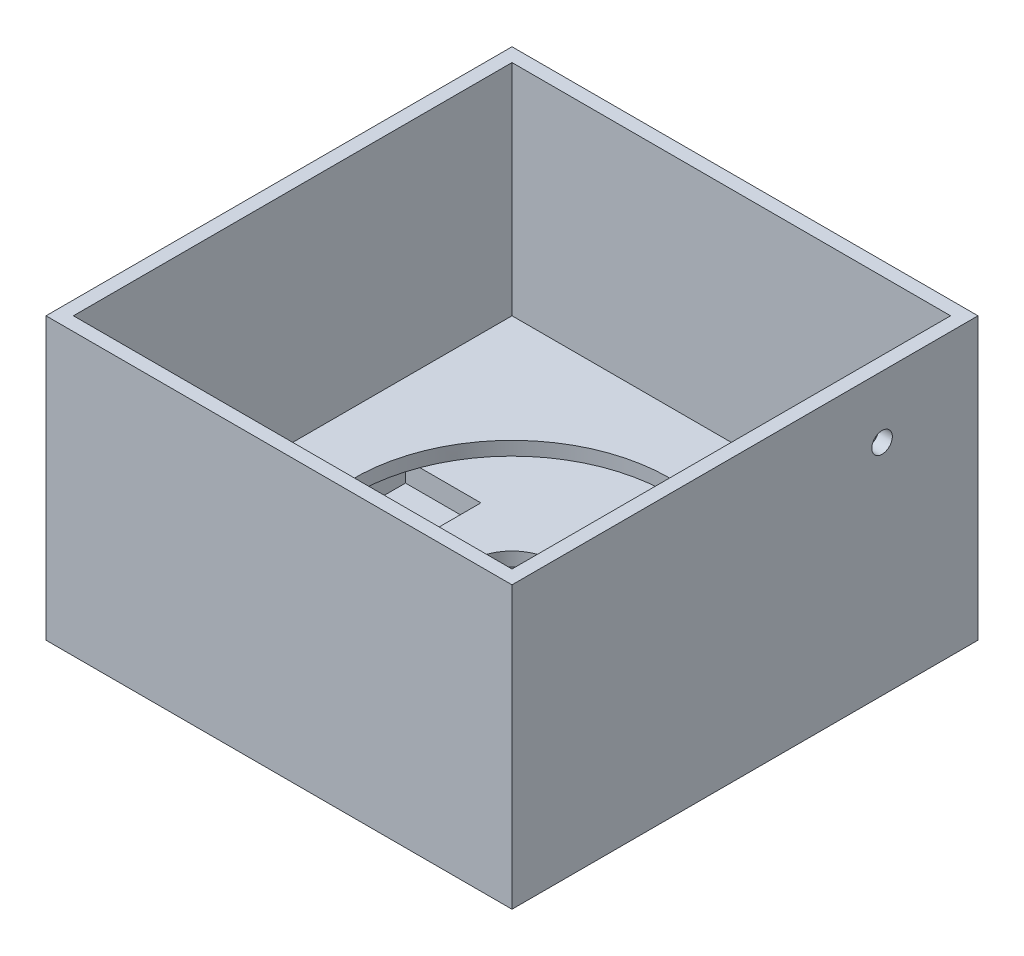
ISO-10303-21;
HEADER;
FILE_DESCRIPTION(('STEP AP214'),'2;1');
FILE_NAME('part.step','',(''),(''),'','','');
FILE_SCHEMA(('AUTOMOTIVE_DESIGN { 1 0 10303 214 1 1 1 1 }'));
ENDSEC;
DATA;
#1=APPLICATION_CONTEXT('core data for automotive mechanical design processes');
#2=APPLICATION_PROTOCOL_DEFINITION('international standard','automotive_design',2000,#1);
#3=PRODUCT_CONTEXT('',#1,'mechanical');
#4=PRODUCT('Part','Part','',(#3));
#5=PRODUCT_RELATED_PRODUCT_CATEGORY('part','',(#4));
#6=PRODUCT_DEFINITION_FORMATION('','',#4);
#7=PRODUCT_DEFINITION_CONTEXT('part definition',#1,'design');
#8=PRODUCT_DEFINITION('design','',#6,#7);
#9=PRODUCT_DEFINITION_SHAPE('','',#8);
#10=(LENGTH_UNIT() NAMED_UNIT(*) SI_UNIT(.MILLI.,.METRE.));
#11=(NAMED_UNIT(*) PLANE_ANGLE_UNIT() SI_UNIT($,.RADIAN.));
#12=(NAMED_UNIT(*) SI_UNIT($,.STERADIAN.) SOLID_ANGLE_UNIT());
#13=UNCERTAINTY_MEASURE_WITH_UNIT(LENGTH_MEASURE(1.E-05),#10,'distance_accuracy_value','');
#14=(GEOMETRIC_REPRESENTATION_CONTEXT(3) GLOBAL_UNCERTAINTY_ASSIGNED_CONTEXT((#13)) GLOBAL_UNIT_ASSIGNED_CONTEXT((#10,
#11,#12)) REPRESENTATION_CONTEXT('',''));
#15=CARTESIAN_POINT('',(0.,0.,0.));
#16=DIRECTION('',(0.,0.,1.));
#17=DIRECTION('',(1.,0.,0.));
#18=AXIS2_PLACEMENT_3D('',#15,#16,#17);
#19=CARTESIAN_POINT('',(0.,0.,0.));
#20=DIRECTION('',(0.,-1.,0.));
#21=DIRECTION('',(0.,0.,-1.));
#22=AXIS2_PLACEMENT_3D('',#19,#20,#21);
#23=PLANE('',#22);
#24=CARTESIAN_POINT('',(0.,0.,0.));
#25=DIRECTION('',(0.,-1.,0.));
#26=DIRECTION('',(0.,0.,-1.));
#27=AXIS2_PLACEMENT_3D('',#24,#25,#26);
#28=CIRCLE('',#27,10.5);
#29=CARTESIAN_POINT('',(0.,0.,-10.5));
#30=VERTEX_POINT('',#29);
#31=EDGE_CURVE('E326',#30,#30,#28,.T.);
#32=ORIENTED_EDGE('',*,*,#31,.F.);
#33=EDGE_LOOP('',(#32));
#34=FACE_BOUND('',#33,.T.);
#35=DIRECTION('',(1.,0.,0.));
#36=VECTOR('',#35,1.);
#37=CARTESIAN_POINT('',(13.,0.,-13.));
#38=LINE('',#37,#36);
#39=CARTESIAN_POINT('',(-13.,0.,-13.));
#40=VERTEX_POINT('',#39);
#41=CARTESIAN_POINT('',(13.,0.,-13.));
#42=VERTEX_POINT('',#41);
#43=EDGE_CURVE('E253',#40,#42,#38,.T.);
#44=ORIENTED_EDGE('',*,*,#43,.T.);
#45=DIRECTION('',(0.,0.,1.));
#46=VECTOR('',#45,1.);
#47=CARTESIAN_POINT('',(13.,0.,-13.));
#48=LINE('',#47,#46);
#49=CARTESIAN_POINT('',(13.,0.,13.));
#50=VERTEX_POINT('',#49);
#51=EDGE_CURVE('E244',#42,#50,#48,.T.);
#52=ORIENTED_EDGE('',*,*,#51,.T.);
#53=DIRECTION('',(-1.,0.,0.));
#54=VECTOR('',#53,1.);
#55=CARTESIAN_POINT('',(13.,0.,13.));
#56=LINE('',#55,#54);
#57=CARTESIAN_POINT('',(-13.,0.,13.));
#58=VERTEX_POINT('',#57);
#59=EDGE_CURVE('E269',#50,#58,#56,.T.);
#60=ORIENTED_EDGE('',*,*,#59,.T.);
#61=DIRECTION('',(0.,0.,-1.));
#62=VECTOR('',#61,1.);
#63=CARTESIAN_POINT('',(-13.,0.,-13.));
#64=LINE('',#63,#62);
#65=EDGE_CURVE('E273',#58,#40,#64,.T.);
#66=ORIENTED_EDGE('',*,*,#65,.T.);
#67=EDGE_LOOP('',(#44,#52,#60,#66));
#68=FACE_BOUND('',#67,.T.);
#69=ADVANCED_FACE('F39',(#34,#68),#23,.T.);
#70=CARTESIAN_POINT('',(0.,0.,0.));
#71=DIRECTION('',(0.,1.,0.));
#72=DIRECTION('',(0.,0.,1.));
#73=AXIS2_PLACEMENT_3D('',#70,#71,#72);
#74=CYLINDRICAL_SURFACE('',#73,6.05);
#75=CARTESIAN_POINT('',(0.,7.,0.));
#76=DIRECTION('',(0.,1.,0.));
#77=DIRECTION('',(0.,0.,1.));
#78=AXIS2_PLACEMENT_3D('',#75,#76,#77);
#79=CIRCLE('',#78,6.05);
#80=CARTESIAN_POINT('',(0.,7.,6.05));
#81=VERTEX_POINT('',#80);
#82=EDGE_CURVE('E343',#81,#81,#79,.T.);
#83=ORIENTED_EDGE('',*,*,#82,.T.);
#84=EDGE_LOOP('',(#83));
#85=FACE_BOUND('',#84,.T.);
#86=CARTESIAN_POINT('',(0.,5.,0.));
#87=DIRECTION('',(0.,-1.,0.));
#88=DIRECTION('',(0.,0.,-1.));
#89=AXIS2_PLACEMENT_3D('',#86,#87,#88);
#90=CIRCLE('',#89,6.05);
#91=CARTESIAN_POINT('',(0.,5.,-6.05));
#92=VERTEX_POINT('',#91);
#93=EDGE_CURVE('E339',#92,#92,#90,.F.);
#94=ORIENTED_EDGE('',*,*,#93,.F.);
#95=EDGE_LOOP('',(#94));
#96=FACE_BOUND('',#95,.T.);
#97=ADVANCED_FACE('F445',(#85,#96),#74,.F.);
#98=CARTESIAN_POINT('',(34.,41.,34.));
#99=DIRECTION('',(-1.,0.,0.));
#100=DIRECTION('',(0.,0.,1.));
#101=AXIS2_PLACEMENT_3D('',#98,#99,#100);
#102=PLANE('',#101);
#103=CARTESIAN_POINT('',(34.,32.,-20.));
#104=DIRECTION('',(-1.,0.,0.));
#105=DIRECTION('',(0.,0.,1.));
#106=AXIS2_PLACEMENT_3D('',#103,#104,#105);
#107=CIRCLE('',#106,1.5);
#108=CARTESIAN_POINT('',(34.,32.,-18.5));
#109=VERTEX_POINT('',#108);
#110=EDGE_CURVE('E240',#109,#109,#107,.T.);
#111=ORIENTED_EDGE('',*,*,#110,.T.);
#112=EDGE_LOOP('',(#111));
#113=FACE_BOUND('',#112,.T.);
#114=DIRECTION('',(0.,0.,-1.));
#115=VECTOR('',#114,1.);
#116=CARTESIAN_POINT('',(34.,0.,34.));
#117=LINE('',#116,#115);
#118=CARTESIAN_POINT('',(34.,0.,34.));
#119=VERTEX_POINT('',#118);
#120=CARTESIAN_POINT('',(34.,0.,-34.));
#121=VERTEX_POINT('',#120);
#122=EDGE_CURVE('E390',#119,#121,#117,.T.);
#123=ORIENTED_EDGE('',*,*,#122,.T.);
#124=DIRECTION('',(0.,-1.,0.));
#125=VECTOR('',#124,1.);
#126=CARTESIAN_POINT('',(34.,41.,-34.));
#127=LINE('',#126,#125);
#128=CARTESIAN_POINT('',(34.,41.,-34.));
#129=VERTEX_POINT('',#128);
#130=EDGE_CURVE('E48',#129,#121,#127,.T.);
#131=ORIENTED_EDGE('',*,*,#130,.F.);
#132=DIRECTION('',(0.,0.,-1.));
#133=VECTOR('',#132,1.);
#134=CARTESIAN_POINT('',(34.,41.,34.));
#135=LINE('',#134,#133);
#136=CARTESIAN_POINT('',(34.,41.,34.));
#137=VERTEX_POINT('',#136);
#138=EDGE_CURVE('E400',#137,#129,#135,.T.);
#139=ORIENTED_EDGE('',*,*,#138,.F.);
#140=DIRECTION('',(0.,-1.,0.));
#141=VECTOR('',#140,1.);
#142=CARTESIAN_POINT('',(34.,41.,34.));
#143=LINE('',#142,#141);
#144=EDGE_CURVE('E414',#137,#119,#143,.T.);
#145=ORIENTED_EDGE('',*,*,#144,.T.);
#146=EDGE_LOOP('',(#123,#131,#139,#145));
#147=FACE_BOUND('',#146,.T.);
#148=ADVANCED_FACE('F41',(#113,#147),#102,.F.);
#149=CARTESIAN_POINT('',(-34.,41.,-34.));
#150=DIRECTION('',(0.,0.,1.));
#151=DIRECTION('',(1.,0.,0.));
#152=AXIS2_PLACEMENT_3D('',#149,#150,#151);
#153=PLANE('',#152);
#154=DIRECTION('',(-1.,0.,0.));
#155=VECTOR('',#154,1.);
#156=CARTESIAN_POINT('',(-34.,0.,-34.));
#157=LINE('',#156,#155);
#158=CARTESIAN_POINT('',(-34.,0.,-34.));
#159=VERTEX_POINT('',#158);
#160=EDGE_CURVE('E418',#121,#159,#157,.T.);
#161=ORIENTED_EDGE('',*,*,#160,.T.);
#162=DIRECTION('',(0.,-1.,0.));
#163=VECTOR('',#162,1.);
#164=CARTESIAN_POINT('',(-34.,41.,-34.));
#165=LINE('',#164,#163);
#166=CARTESIAN_POINT('',(-34.,41.,-34.));
#167=VERTEX_POINT('',#166);
#168=EDGE_CURVE('E433',#167,#159,#165,.T.);
#169=ORIENTED_EDGE('',*,*,#168,.F.);
#170=DIRECTION('',(-1.,0.,0.));
#171=VECTOR('',#170,1.);
#172=CARTESIAN_POINT('',(-34.,41.,-34.));
#173=LINE('',#172,#171);
#174=EDGE_CURVE('E404',#129,#167,#173,.T.);
#175=ORIENTED_EDGE('',*,*,#174,.F.);
#176=ORIENTED_EDGE('',*,*,#130,.T.);
#177=EDGE_LOOP('',(#161,#169,#175,#176));
#178=FACE_BOUND('',#177,.T.);
#179=ADVANCED_FACE('F453',(#178),#153,.F.);
#180=CARTESIAN_POINT('',(-34.,41.,34.));
#181=DIRECTION('',(1.,0.,0.));
#182=DIRECTION('',(0.,0.,-1.));
#183=AXIS2_PLACEMENT_3D('',#180,#181,#182);
#184=PLANE('',#183);
#185=DIRECTION('',(0.,0.,1.));
#186=VECTOR('',#185,1.);
#187=CARTESIAN_POINT('',(-34.,0.,34.));
#188=LINE('',#187,#186);
#189=CARTESIAN_POINT('',(-34.,0.,34.));
#190=VERTEX_POINT('',#189);
#191=EDGE_CURVE('E421',#159,#190,#188,.T.);
#192=ORIENTED_EDGE('',*,*,#191,.T.);
#193=DIRECTION('',(0.,-1.,0.));
#194=VECTOR('',#193,1.);
#195=CARTESIAN_POINT('',(-34.,41.,34.));
#196=LINE('',#195,#194);
#197=CARTESIAN_POINT('',(-34.,41.,34.));
#198=VERTEX_POINT('',#197);
#199=EDGE_CURVE('E429',#198,#190,#196,.T.);
#200=ORIENTED_EDGE('',*,*,#199,.F.);
#201=DIRECTION('',(0.,0.,1.));
#202=VECTOR('',#201,1.);
#203=CARTESIAN_POINT('',(-34.,41.,34.));
#204=LINE('',#203,#202);
#205=EDGE_CURVE('E408',#167,#198,#204,.T.);
#206=ORIENTED_EDGE('',*,*,#205,.F.);
#207=ORIENTED_EDGE('',*,*,#168,.T.);
#208=EDGE_LOOP('',(#192,#200,#206,#207));
#209=FACE_BOUND('',#208,.T.);
#210=ADVANCED_FACE('F500',(#209),#184,.F.);
#211=CARTESIAN_POINT('',(-34.,41.,34.));
#212=DIRECTION('',(0.,0.,-1.));
#213=DIRECTION('',(-1.,0.,0.));
#214=AXIS2_PLACEMENT_3D('',#211,#212,#213);
#215=PLANE('',#214);
#216=DIRECTION('',(1.,0.,0.));
#217=VECTOR('',#216,1.);
#218=CARTESIAN_POINT('',(-34.,0.,34.));
#219=LINE('',#218,#217);
#220=EDGE_CURVE('E405',#190,#119,#219,.T.);
#221=ORIENTED_EDGE('',*,*,#220,.T.);
#222=ORIENTED_EDGE('',*,*,#144,.F.);
#223=DIRECTION('',(1.,0.,0.));
#224=VECTOR('',#223,1.);
#225=CARTESIAN_POINT('',(-34.,41.,34.));
#226=LINE('',#225,#224);
#227=EDGE_CURVE('E411',#198,#137,#226,.T.);
#228=ORIENTED_EDGE('',*,*,#227,.F.);
#229=ORIENTED_EDGE('',*,*,#199,.T.);
#230=EDGE_LOOP('',(#221,#222,#228,#229));
#231=FACE_BOUND('',#230,.T.);
#232=ADVANCED_FACE('F493',(#231),#215,.F.);
#233=CARTESIAN_POINT('',(0.,41.,0.));
#234=DIRECTION('',(0.,-1.,0.));
#235=DIRECTION('',(0.,0.,-1.));
#236=AXIS2_PLACEMENT_3D('',#233,#234,#235);
#237=PLANE('',#236);
#238=DIRECTION('',(-1.,0.,0.));
#239=VECTOR('',#238,1.);
#240=CARTESIAN_POINT('',(0.,41.,-32.));
#241=LINE('',#240,#239);
#242=CARTESIAN_POINT('',(32.,41.,-32.));
#243=VERTEX_POINT('',#242);
#244=CARTESIAN_POINT('',(-32.,41.,-32.));
#245=VERTEX_POINT('',#244);
#246=EDGE_CURVE('E376',#243,#245,#241,.T.);
#247=ORIENTED_EDGE('',*,*,#246,.F.);
#248=DIRECTION('',(0.,0.,-1.));
#249=VECTOR('',#248,1.);
#250=CARTESIAN_POINT('',(32.,41.,0.));
#251=LINE('',#250,#249);
#252=CARTESIAN_POINT('',(32.,41.,32.));
#253=VERTEX_POINT('',#252);
#254=EDGE_CURVE('E351',#253,#243,#251,.T.);
#255=ORIENTED_EDGE('',*,*,#254,.F.);
#256=DIRECTION('',(1.,0.,0.));
#257=VECTOR('',#256,1.);
#258=CARTESIAN_POINT('',(0.,41.,32.));
#259=LINE('',#258,#257);
#260=CARTESIAN_POINT('',(-32.,41.,32.));
#261=VERTEX_POINT('',#260);
#262=EDGE_CURVE('E361',#261,#253,#259,.T.);
#263=ORIENTED_EDGE('',*,*,#262,.F.);
#264=DIRECTION('',(0.,0.,1.));
#265=VECTOR('',#264,1.);
#266=CARTESIAN_POINT('',(-32.,41.,0.));
#267=LINE('',#266,#265);
#268=EDGE_CURVE('E380',#245,#261,#267,.T.);
#269=ORIENTED_EDGE('',*,*,#268,.F.);
#270=EDGE_LOOP('',(#247,#255,#263,#269));
#271=FACE_BOUND('',#270,.T.);
#272=ORIENTED_EDGE('',*,*,#138,.T.);
#273=ORIENTED_EDGE('',*,*,#174,.T.);
#274=ORIENTED_EDGE('',*,*,#205,.T.);
#275=ORIENTED_EDGE('',*,*,#227,.T.);
#276=EDGE_LOOP('',(#272,#273,#274,#275));
#277=FACE_BOUND('',#276,.T.);
#278=ADVANCED_FACE('F491',(#271,#277),#237,.F.);
#279=DIRECTION('',(0.,0.,1.));
#280=VECTOR('',#279,1.);
#281=CARTESIAN_POINT('',(15.,0.,-15.));
#282=LINE('',#281,#280);
#283=CARTESIAN_POINT('',(15.,0.,-15.));
#284=VERTEX_POINT('',#283);
#285=CARTESIAN_POINT('',(15.,0.,15.));
#286=VERTEX_POINT('',#285);
#287=EDGE_CURVE('E62',#284,#286,#282,.T.);
#288=ORIENTED_EDGE('',*,*,#287,.F.);
#289=DIRECTION('',(1.,0.,0.));
#290=VECTOR('',#289,1.);
#291=CARTESIAN_POINT('',(15.,0.,-15.));
#292=LINE('',#291,#290);
#293=CARTESIAN_POINT('',(-15.,0.,-15.));
#294=VERTEX_POINT('',#293);
#295=EDGE_CURVE('E297',#294,#284,#292,.T.);
#296=ORIENTED_EDGE('',*,*,#295,.F.);
#297=DIRECTION('',(0.,0.,-1.));
#298=VECTOR('',#297,1.);
#299=CARTESIAN_POINT('',(-15.,0.,-15.));
#300=LINE('',#299,#298);
#301=CARTESIAN_POINT('',(-15.,0.,15.));
#302=VERTEX_POINT('',#301);
#303=EDGE_CURVE('E316',#302,#294,#300,.T.);
#304=ORIENTED_EDGE('',*,*,#303,.F.);
#305=DIRECTION('',(-1.,0.,0.));
#306=VECTOR('',#305,1.);
#307=CARTESIAN_POINT('',(15.,0.,15.));
#308=LINE('',#307,#306);
#309=EDGE_CURVE('E312',#286,#302,#308,.T.);
#310=ORIENTED_EDGE('',*,*,#309,.F.);
#311=EDGE_LOOP('',(#288,#296,#304,#310));
#312=FACE_BOUND('',#311,.T.);
#313=ORIENTED_EDGE('',*,*,#122,.F.);
#314=ORIENTED_EDGE('',*,*,#220,.F.);
#315=ORIENTED_EDGE('',*,*,#191,.F.);
#316=ORIENTED_EDGE('',*,*,#160,.F.);
#317=EDGE_LOOP('',(#313,#314,#315,#316));
#318=FACE_BOUND('',#317,.T.);
#319=ADVANCED_FACE('F457',(#312,#318),#23,.T.);
#320=CARTESIAN_POINT('',(32.,9.,0.));
#321=DIRECTION('',(1.,0.,0.));
#322=DIRECTION('',(0.,0.,-1.));
#323=AXIS2_PLACEMENT_3D('',#320,#321,#322);
#324=PLANE('',#323);
#325=CARTESIAN_POINT('',(32.,32.,-20.));
#326=DIRECTION('',(-1.,0.,0.));
#327=DIRECTION('',(0.,0.,1.));
#328=AXIS2_PLACEMENT_3D('',#325,#326,#327);
#329=CIRCLE('',#328,1.5);
#330=CARTESIAN_POINT('',(32.,32.,-18.5));
#331=VERTEX_POINT('',#330);
#332=EDGE_CURVE('E234',#331,#331,#329,.T.);
#333=ORIENTED_EDGE('',*,*,#332,.F.);
#334=EDGE_LOOP('',(#333));
#335=FACE_BOUND('',#334,.T.);
#336=ORIENTED_EDGE('',*,*,#254,.T.);
#337=DIRECTION('',(0.,1.,0.));
#338=VECTOR('',#337,1.);
#339=CARTESIAN_POINT('',(32.,9.,-32.));
#340=LINE('',#339,#338);
#341=CARTESIAN_POINT('',(32.,9.,-32.));
#342=VERTEX_POINT('',#341);
#343=EDGE_CURVE('E373',#342,#243,#340,.T.);
#344=ORIENTED_EDGE('',*,*,#343,.F.);
#345=DIRECTION('',(0.,0.,-1.));
#346=VECTOR('',#345,1.);
#347=CARTESIAN_POINT('',(32.,9.,0.));
#348=LINE('',#347,#346);
#349=CARTESIAN_POINT('',(32.,9.,32.));
#350=VERTEX_POINT('',#349);
#351=EDGE_CURVE('E356',#350,#342,#348,.T.);
#352=ORIENTED_EDGE('',*,*,#351,.F.);
#353=DIRECTION('',(0.,1.,0.));
#354=VECTOR('',#353,1.);
#355=CARTESIAN_POINT('',(32.,9.,32.));
#356=LINE('',#355,#354);
#357=EDGE_CURVE('E387',#350,#253,#356,.T.);
#358=ORIENTED_EDGE('',*,*,#357,.T.);
#359=EDGE_LOOP('',(#336,#344,#352,#358));
#360=FACE_BOUND('',#359,.T.);
#361=ADVANCED_FACE('F480',(#335,#360),#324,.F.);
#362=CARTESIAN_POINT('',(0.,9.,32.));
#363=DIRECTION('',(0.,0.,1.));
#364=DIRECTION('',(1.,0.,0.));
#365=AXIS2_PLACEMENT_3D('',#362,#363,#364);
#366=PLANE('',#365);
#367=ORIENTED_EDGE('',*,*,#262,.T.);
#368=ORIENTED_EDGE('',*,*,#357,.F.);
#369=DIRECTION('',(1.,0.,0.));
#370=VECTOR('',#369,1.);
#371=CARTESIAN_POINT('',(0.,9.,32.));
#372=LINE('',#371,#370);
#373=CARTESIAN_POINT('',(-32.,9.,32.));
#374=VERTEX_POINT('',#373);
#375=EDGE_CURVE('E369',#374,#350,#372,.T.);
#376=ORIENTED_EDGE('',*,*,#375,.F.);
#377=DIRECTION('',(0.,1.,0.));
#378=VECTOR('',#377,1.);
#379=CARTESIAN_POINT('',(-32.,9.,32.));
#380=LINE('',#379,#378);
#381=EDGE_CURVE('E391',#374,#261,#380,.T.);
#382=ORIENTED_EDGE('',*,*,#381,.T.);
#383=EDGE_LOOP('',(#367,#368,#376,#382));
#384=FACE_BOUND('',#383,.T.);
#385=ADVANCED_FACE('F476',(#384),#366,.F.);
#386=CARTESIAN_POINT('',(-32.,9.,0.));
#387=DIRECTION('',(-1.,0.,0.));
#388=DIRECTION('',(0.,0.,1.));
#389=AXIS2_PLACEMENT_3D('',#386,#387,#388);
#390=PLANE('',#389);
#391=ORIENTED_EDGE('',*,*,#268,.T.);
#392=ORIENTED_EDGE('',*,*,#381,.F.);
#393=DIRECTION('',(0.,0.,1.));
#394=VECTOR('',#393,1.);
#395=CARTESIAN_POINT('',(-32.,9.,0.));
#396=LINE('',#395,#394);
#397=CARTESIAN_POINT('',(-32.,9.,-32.));
#398=VERTEX_POINT('',#397);
#399=EDGE_CURVE('E365',#398,#374,#396,.T.);
#400=ORIENTED_EDGE('',*,*,#399,.F.);
#401=DIRECTION('',(0.,1.,0.));
#402=VECTOR('',#401,1.);
#403=CARTESIAN_POINT('',(-32.,9.,-32.));
#404=LINE('',#403,#402);
#405=EDGE_CURVE('E394',#398,#245,#404,.T.);
#406=ORIENTED_EDGE('',*,*,#405,.T.);
#407=EDGE_LOOP('',(#391,#392,#400,#406));
#408=FACE_BOUND('',#407,.T.);
#409=ADVANCED_FACE('F479',(#408),#390,.F.);
#410=CARTESIAN_POINT('',(0.,9.,-32.));
#411=DIRECTION('',(0.,0.,-1.));
#412=DIRECTION('',(-1.,0.,0.));
#413=AXIS2_PLACEMENT_3D('',#410,#411,#412);
#414=PLANE('',#413);
#415=ORIENTED_EDGE('',*,*,#246,.T.);
#416=ORIENTED_EDGE('',*,*,#405,.F.);
#417=DIRECTION('',(-1.,0.,0.));
#418=VECTOR('',#417,1.);
#419=CARTESIAN_POINT('',(0.,9.,-32.));
#420=LINE('',#419,#418);
#421=EDGE_CURVE('E360',#342,#398,#420,.T.);
#422=ORIENTED_EDGE('',*,*,#421,.F.);
#423=ORIENTED_EDGE('',*,*,#343,.T.);
#424=EDGE_LOOP('',(#415,#416,#422,#423));
#425=FACE_BOUND('',#424,.T.);
#426=ADVANCED_FACE('F474',(#425),#414,.F.);
#427=CARTESIAN_POINT('',(0.,9.,0.));
#428=DIRECTION('',(0.,1.,0.));
#429=DIRECTION('',(0.,0.,1.));
#430=AXIS2_PLACEMENT_3D('',#427,#428,#429);
#431=PLANE('',#430);
#432=CARTESIAN_POINT('',(0.,9.,0.));
#433=DIRECTION('',(0.,1.,0.));
#434=DIRECTION('',(0.,0.,1.));
#435=AXIS2_PLACEMENT_3D('',#432,#433,#434);
#436=CIRCLE('',#435,23.);
#437=CARTESIAN_POINT('',(0.,9.,23.));
#438=VERTEX_POINT('',#437);
#439=EDGE_CURVE('E347',#438,#438,#436,.T.);
#440=ORIENTED_EDGE('',*,*,#439,.F.);
#441=EDGE_LOOP('',(#440));
#442=FACE_BOUND('',#441,.T.);
#443=ORIENTED_EDGE('',*,*,#351,.T.);
#444=ORIENTED_EDGE('',*,*,#421,.T.);
#445=ORIENTED_EDGE('',*,*,#399,.T.);
#446=ORIENTED_EDGE('',*,*,#375,.T.);
#447=EDGE_LOOP('',(#443,#444,#445,#446));
#448=FACE_BOUND('',#447,.T.);
#449=ADVANCED_FACE('F470',(#442,#448),#431,.T.);
#450=CARTESIAN_POINT('',(0.,7.,0.));
#451=DIRECTION('',(0.,1.,0.));
#452=DIRECTION('',(0.,0.,1.));
#453=AXIS2_PLACEMENT_3D('',#450,#451,#452);
#454=CYLINDRICAL_SURFACE('',#453,23.);
#455=CARTESIAN_POINT('',(0.,7.,0.));
#456=DIRECTION('',(0.,1.,0.));
#457=DIRECTION('',(0.,0.,1.));
#458=AXIS2_PLACEMENT_3D('',#455,#456,#457);
#459=CIRCLE('',#458,23.);
#460=CARTESIAN_POINT('',(-21.5316964114081,7.,-8.08616408731332));
#461=VERTEX_POINT('',#460);
#462=CARTESIAN_POINT('',(-21.5956292139653,7.,7.91383591268668));
#463=VERTEX_POINT('',#462);
#464=EDGE_CURVE('E348',#461,#463,#459,.T.);
#465=ORIENTED_EDGE('',*,*,#464,.F.);
#466=EDGE_CURVE('E352',#463,#461,#459,.T.);
#467=ORIENTED_EDGE('',*,*,#466,.F.);
#468=EDGE_LOOP('',(#465,#467));
#469=FACE_BOUND('',#468,.T.);
#470=ORIENTED_EDGE('',*,*,#439,.T.);
#471=EDGE_LOOP('',(#470));
#472=FACE_BOUND('',#471,.T.);
#473=ADVANCED_FACE('F465',(#469,#472),#454,.F.);
#474=CARTESIAN_POINT('',(0.,7.,0.));
#475=DIRECTION('',(0.,1.,0.));
#476=DIRECTION('',(0.,0.,1.));
#477=AXIS2_PLACEMENT_3D('',#474,#475,#476);
#478=PLANE('',#477);
#479=DIRECTION('',(-1.,0.,0.));
#480=VECTOR('',#479,1.);
#481=CARTESIAN_POINT('',(-12.6259035290733,7.,-8.08616408731332));
#482=LINE('',#481,#480);
#483=CARTESIAN_POINT('',(-12.6259035290733,7.,-8.08616408731332));
#484=VERTEX_POINT('',#483);
#485=EDGE_CURVE('E208',#484,#461,#482,.T.);
#486=ORIENTED_EDGE('',*,*,#485,.F.);
#487=DIRECTION('',(0.,0.,-1.));
#488=VECTOR('',#487,1.);
#489=CARTESIAN_POINT('',(-12.6259035290733,7.,7.91383591268668));
#490=LINE('',#489,#488);
#491=CARTESIAN_POINT('',(-12.6259035290733,7.,7.91383591268668));
#492=VERTEX_POINT('',#491);
#493=EDGE_CURVE('E227',#492,#484,#490,.T.);
#494=ORIENTED_EDGE('',*,*,#493,.F.);
#495=DIRECTION('',(1.,0.,0.));
#496=VECTOR('',#495,1.);
#497=CARTESIAN_POINT('',(0.,7.,7.91383591268668));
#498=LINE('',#497,#496);
#499=EDGE_CURVE('E11',#463,#492,#498,.T.);
#500=ORIENTED_EDGE('',*,*,#499,.F.);
#501=ORIENTED_EDGE('',*,*,#466,.T.);
#502=EDGE_LOOP('',(#486,#494,#500,#501));
#503=FACE_BOUND('',#502,.T.);
#504=ORIENTED_EDGE('',*,*,#82,.F.);
#505=EDGE_LOOP('',(#504));
#506=FACE_BOUND('',#505,.T.);
#507=ADVANCED_FACE('F462',(#503,#506),#478,.T.);
#508=CARTESIAN_POINT('',(0.,5.,0.));
#509=DIRECTION('',(0.,-1.,0.));
#510=DIRECTION('',(0.,0.,-1.));
#511=AXIS2_PLACEMENT_3D('',#508,#509,#510);
#512=PLANE('',#511);
#513=CARTESIAN_POINT('',(0.,5.,0.));
#514=DIRECTION('',(0.,-1.,0.));
#515=DIRECTION('',(0.,0.,-1.));
#516=AXIS2_PLACEMENT_3D('',#513,#514,#515);
#517=CIRCLE('',#516,10.5);
#518=CARTESIAN_POINT('',(0.,5.,-10.5));
#519=VERTEX_POINT('',#518);
#520=EDGE_CURVE('E335',#519,#519,#517,.T.);
#521=ORIENTED_EDGE('',*,*,#520,.T.);
#522=EDGE_LOOP('',(#521));
#523=FACE_BOUND('',#522,.T.);
#524=ORIENTED_EDGE('',*,*,#93,.T.);
#525=EDGE_LOOP('',(#524));
#526=FACE_BOUND('',#525,.T.);
#527=ADVANCED_FACE('F443',(#523,#526),#512,.T.);
#528=CARTESIAN_POINT('',(0.,5.,0.));
#529=DIRECTION('',(0.,-1.,0.));
#530=DIRECTION('',(0.,0.,-1.));
#531=AXIS2_PLACEMENT_3D('',#528,#529,#530);
#532=CYLINDRICAL_SURFACE('',#531,10.5);
#533=ORIENTED_EDGE('',*,*,#520,.F.);
#534=EDGE_LOOP('',(#533));
#535=FACE_BOUND('',#534,.T.);
#536=ORIENTED_EDGE('',*,*,#31,.T.);
#537=EDGE_LOOP('',(#536));
#538=FACE_BOUND('',#537,.T.);
#539=ADVANCED_FACE('F460',(#535,#538),#532,.F.);
#540=CARTESIAN_POINT('',(15.,2.,-15.));
#541=DIRECTION('',(1.,0.,0.));
#542=DIRECTION('',(0.,0.,-1.));
#543=AXIS2_PLACEMENT_3D('',#540,#541,#542);
#544=PLANE('',#543);
#545=ORIENTED_EDGE('',*,*,#287,.T.);
#546=DIRECTION('',(0.,-1.,0.));
#547=VECTOR('',#546,1.);
#548=CARTESIAN_POINT('',(15.,2.,15.));
#549=LINE('',#548,#547);
#550=CARTESIAN_POINT('',(15.,2.,15.));
#551=VERTEX_POINT('',#550);
#552=EDGE_CURVE('E309',#551,#286,#549,.T.);
#553=ORIENTED_EDGE('',*,*,#552,.F.);
#554=DIRECTION('',(0.,0.,1.));
#555=VECTOR('',#554,1.);
#556=CARTESIAN_POINT('',(15.,2.,-15.));
#557=LINE('',#556,#555);
#558=CARTESIAN_POINT('',(15.,2.,-15.));
#559=VERTEX_POINT('',#558);
#560=EDGE_CURVE('E292',#559,#551,#557,.T.);
#561=ORIENTED_EDGE('',*,*,#560,.F.);
#562=DIRECTION('',(0.,-1.,0.));
#563=VECTOR('',#562,1.);
#564=CARTESIAN_POINT('',(15.,2.,-15.));
#565=LINE('',#564,#563);
#566=EDGE_CURVE('E323',#559,#284,#565,.T.);
#567=ORIENTED_EDGE('',*,*,#566,.T.);
#568=EDGE_LOOP('',(#545,#553,#561,#567));
#569=FACE_BOUND('',#568,.T.);
#570=ADVANCED_FACE('F583',(#569),#544,.F.);
#571=CARTESIAN_POINT('',(15.,2.,-15.));
#572=DIRECTION('',(0.,0.,-1.));
#573=DIRECTION('',(-1.,0.,0.));
#574=AXIS2_PLACEMENT_3D('',#571,#572,#573);
#575=PLANE('',#574);
#576=ORIENTED_EDGE('',*,*,#295,.T.);
#577=ORIENTED_EDGE('',*,*,#566,.F.);
#578=DIRECTION('',(1.,0.,0.));
#579=VECTOR('',#578,1.);
#580=CARTESIAN_POINT('',(15.,2.,-15.));
#581=LINE('',#580,#579);
#582=CARTESIAN_POINT('',(-15.,2.,-15.));
#583=VERTEX_POINT('',#582);
#584=EDGE_CURVE('E305',#583,#559,#581,.T.);
#585=ORIENTED_EDGE('',*,*,#584,.F.);
#586=DIRECTION('',(0.,-1.,0.));
#587=VECTOR('',#586,1.);
#588=CARTESIAN_POINT('',(-15.,2.,-15.));
#589=LINE('',#588,#587);
#590=EDGE_CURVE('E327',#583,#294,#589,.T.);
#591=ORIENTED_EDGE('',*,*,#590,.T.);
#592=EDGE_LOOP('',(#576,#577,#585,#591));
#593=FACE_BOUND('',#592,.T.);
#594=ADVANCED_FACE('F589',(#593),#575,.F.);
#595=CARTESIAN_POINT('',(-15.,2.,-15.));
#596=DIRECTION('',(-1.,0.,0.));
#597=DIRECTION('',(0.,0.,1.));
#598=AXIS2_PLACEMENT_3D('',#595,#596,#597);
#599=PLANE('',#598);
#600=ORIENTED_EDGE('',*,*,#303,.T.);
#601=ORIENTED_EDGE('',*,*,#590,.F.);
#602=DIRECTION('',(0.,0.,-1.));
#603=VECTOR('',#602,1.);
#604=CARTESIAN_POINT('',(-15.,2.,-15.));
#605=LINE('',#604,#603);
#606=CARTESIAN_POINT('',(-15.,2.,15.));
#607=VERTEX_POINT('',#606);
#608=EDGE_CURVE('E301',#607,#583,#605,.T.);
#609=ORIENTED_EDGE('',*,*,#608,.F.);
#610=DIRECTION('',(0.,-1.,0.));
#611=VECTOR('',#610,1.);
#612=CARTESIAN_POINT('',(-15.,2.,15.));
#613=LINE('',#612,#611);
#614=EDGE_CURVE('E330',#607,#302,#613,.T.);
#615=ORIENTED_EDGE('',*,*,#614,.T.);
#616=EDGE_LOOP('',(#600,#601,#609,#615));
#617=FACE_BOUND('',#616,.T.);
#618=ADVANCED_FACE('F596',(#617),#599,.F.);
#619=CARTESIAN_POINT('',(15.,2.,15.));
#620=DIRECTION('',(0.,0.,1.));
#621=DIRECTION('',(1.,0.,0.));
#622=AXIS2_PLACEMENT_3D('',#619,#620,#621);
#623=PLANE('',#622);
#624=ORIENTED_EDGE('',*,*,#309,.T.);
#625=ORIENTED_EDGE('',*,*,#614,.F.);
#626=DIRECTION('',(-1.,0.,0.));
#627=VECTOR('',#626,1.);
#628=CARTESIAN_POINT('',(15.,2.,15.));
#629=LINE('',#628,#627);
#630=EDGE_CURVE('E296',#551,#607,#629,.T.);
#631=ORIENTED_EDGE('',*,*,#630,.F.);
#632=ORIENTED_EDGE('',*,*,#552,.T.);
#633=EDGE_LOOP('',(#624,#625,#631,#632));
#634=FACE_BOUND('',#633,.T.);
#635=ADVANCED_FACE('F604',(#634),#623,.F.);
#636=CARTESIAN_POINT('',(0.,2.,0.));
#637=DIRECTION('',(0.,-1.,0.));
#638=DIRECTION('',(0.,0.,-1.));
#639=AXIS2_PLACEMENT_3D('',#636,#637,#638);
#640=PLANE('',#639);
#641=DIRECTION('',(1.,0.,0.));
#642=VECTOR('',#641,1.);
#643=CARTESIAN_POINT('',(13.,2.,-13.));
#644=LINE('',#643,#642);
#645=CARTESIAN_POINT('',(-13.,2.,-13.));
#646=VERTEX_POINT('',#645);
#647=CARTESIAN_POINT('',(13.,2.,-13.));
#648=VERTEX_POINT('',#647);
#649=EDGE_CURVE('E261',#646,#648,#644,.T.);
#650=ORIENTED_EDGE('',*,*,#649,.F.);
#651=DIRECTION('',(0.,0.,-1.));
#652=VECTOR('',#651,1.);
#653=CARTESIAN_POINT('',(-13.,2.,-13.));
#654=LINE('',#653,#652);
#655=CARTESIAN_POINT('',(-13.,2.,13.));
#656=VERTEX_POINT('',#655);
#657=EDGE_CURVE('E257',#656,#646,#654,.T.);
#658=ORIENTED_EDGE('',*,*,#657,.F.);
#659=DIRECTION('',(-1.,0.,0.));
#660=VECTOR('',#659,1.);
#661=CARTESIAN_POINT('',(13.,2.,13.));
#662=LINE('',#661,#660);
#663=CARTESIAN_POINT('',(13.,2.,13.));
#664=VERTEX_POINT('',#663);
#665=EDGE_CURVE('E252',#664,#656,#662,.T.);
#666=ORIENTED_EDGE('',*,*,#665,.F.);
#667=DIRECTION('',(0.,0.,1.));
#668=VECTOR('',#667,1.);
#669=CARTESIAN_POINT('',(13.,2.,-13.));
#670=LINE('',#669,#668);
#671=EDGE_CURVE('E248',#648,#664,#670,.T.);
#672=ORIENTED_EDGE('',*,*,#671,.F.);
#673=EDGE_LOOP('',(#650,#658,#666,#672));
#674=FACE_BOUND('',#673,.T.);
#675=ORIENTED_EDGE('',*,*,#560,.T.);
#676=ORIENTED_EDGE('',*,*,#630,.T.);
#677=ORIENTED_EDGE('',*,*,#608,.T.);
#678=ORIENTED_EDGE('',*,*,#584,.T.);
#679=EDGE_LOOP('',(#675,#676,#677,#678));
#680=FACE_BOUND('',#679,.T.);
#681=ADVANCED_FACE('F612',(#674,#680),#640,.T.);
#682=CARTESIAN_POINT('',(13.,2.,-13.));
#683=DIRECTION('',(1.,0.,0.));
#684=DIRECTION('',(0.,0.,-1.));
#685=AXIS2_PLACEMENT_3D('',#682,#683,#684);
#686=PLANE('',#685);
#687=ORIENTED_EDGE('',*,*,#51,.F.);
#688=DIRECTION('',(0.,-1.,0.));
#689=VECTOR('',#688,1.);
#690=CARTESIAN_POINT('',(13.,2.,-13.));
#691=LINE('',#690,#689);
#692=EDGE_CURVE('E280',#648,#42,#691,.T.);
#693=ORIENTED_EDGE('',*,*,#692,.F.);
#694=ORIENTED_EDGE('',*,*,#671,.T.);
#695=DIRECTION('',(0.,-1.,0.));
#696=VECTOR('',#695,1.);
#697=CARTESIAN_POINT('',(13.,2.,13.));
#698=LINE('',#697,#696);
#699=EDGE_CURVE('E265',#664,#50,#698,.T.);
#700=ORIENTED_EDGE('',*,*,#699,.T.);
#701=EDGE_LOOP('',(#687,#693,#694,#700));
#702=FACE_BOUND('',#701,.T.);
#703=ADVANCED_FACE('F620',(#702),#686,.T.);
#704=CARTESIAN_POINT('',(13.,2.,-13.));
#705=DIRECTION('',(0.,0.,-1.));
#706=DIRECTION('',(-1.,0.,0.));
#707=AXIS2_PLACEMENT_3D('',#704,#705,#706);
#708=PLANE('',#707);
#709=ORIENTED_EDGE('',*,*,#43,.F.);
#710=DIRECTION('',(0.,-1.,0.));
#711=VECTOR('',#710,1.);
#712=CARTESIAN_POINT('',(-13.,2.,-13.));
#713=LINE('',#712,#711);
#714=EDGE_CURVE('E283',#646,#40,#713,.T.);
#715=ORIENTED_EDGE('',*,*,#714,.F.);
#716=ORIENTED_EDGE('',*,*,#649,.T.);
#717=ORIENTED_EDGE('',*,*,#692,.T.);
#718=EDGE_LOOP('',(#709,#715,#716,#717));
#719=FACE_BOUND('',#718,.T.);
#720=ADVANCED_FACE('F628',(#719),#708,.T.);
#721=CARTESIAN_POINT('',(-13.,2.,-13.));
#722=DIRECTION('',(-1.,0.,0.));
#723=DIRECTION('',(0.,0.,1.));
#724=AXIS2_PLACEMENT_3D('',#721,#722,#723);
#725=PLANE('',#724);
#726=ORIENTED_EDGE('',*,*,#65,.F.);
#727=DIRECTION('',(0.,-1.,0.));
#728=VECTOR('',#727,1.);
#729=CARTESIAN_POINT('',(-13.,2.,13.));
#730=LINE('',#729,#728);
#731=EDGE_CURVE('E286',#656,#58,#730,.T.);
#732=ORIENTED_EDGE('',*,*,#731,.F.);
#733=ORIENTED_EDGE('',*,*,#657,.T.);
#734=ORIENTED_EDGE('',*,*,#714,.T.);
#735=EDGE_LOOP('',(#726,#732,#733,#734));
#736=FACE_BOUND('',#735,.T.);
#737=ADVANCED_FACE('F636',(#736),#725,.T.);
#738=CARTESIAN_POINT('',(13.,2.,13.));
#739=DIRECTION('',(0.,0.,1.));
#740=DIRECTION('',(1.,0.,0.));
#741=AXIS2_PLACEMENT_3D('',#738,#739,#740);
#742=PLANE('',#741);
#743=ORIENTED_EDGE('',*,*,#59,.F.);
#744=ORIENTED_EDGE('',*,*,#699,.F.);
#745=ORIENTED_EDGE('',*,*,#665,.T.);
#746=ORIENTED_EDGE('',*,*,#731,.T.);
#747=EDGE_LOOP('',(#743,#744,#745,#746));
#748=FACE_BOUND('',#747,.T.);
#749=ADVANCED_FACE('F644',(#748),#742,.T.);
#750=CARTESIAN_POINT('',(34.,32.,-20.));
#751=DIRECTION('',(-1.,0.,0.));
#752=DIRECTION('',(0.,0.,1.));
#753=AXIS2_PLACEMENT_3D('',#750,#751,#752);
#754=CYLINDRICAL_SURFACE('',#753,1.5);
#755=ORIENTED_EDGE('',*,*,#110,.F.);
#756=EDGE_LOOP('',(#755));
#757=FACE_BOUND('',#756,.T.);
#758=ORIENTED_EDGE('',*,*,#332,.T.);
#759=EDGE_LOOP('',(#758));
#760=FACE_BOUND('',#759,.T.);
#761=ADVANCED_FACE('F652',(#757,#760),#754,.F.);
#762=CARTESIAN_POINT('',(0.,7.,0.));
#763=DIRECTION('',(0.,1.,0.));
#764=DIRECTION('',(0.,0.,1.));
#765=AXIS2_PLACEMENT_3D('',#762,#763,#764);
#766=PLANE('',#765);
#767=DIRECTION('',(1.,0.,0.));
#768=VECTOR('',#767,1.);
#769=CARTESIAN_POINT('',(-12.6259035290733,7.,7.91383591268668));
#770=LINE('',#769,#768);
#771=CARTESIAN_POINT('',(-23.6259035290733,7.,7.91383591268668));
#772=VERTEX_POINT('',#771);
#773=EDGE_CURVE('E54',#772,#463,#770,.T.);
#774=ORIENTED_EDGE('',*,*,#773,.F.);
#775=DIRECTION('',(0.,0.,1.));
#776=VECTOR('',#775,1.);
#777=CARTESIAN_POINT('',(-23.6259035290733,7.,7.91383591268668));
#778=LINE('',#777,#776);
#779=CARTESIAN_POINT('',(-23.6259035290733,7.,-8.08616408731332));
#780=VERTEX_POINT('',#779);
#781=EDGE_CURVE('E190',#780,#772,#778,.T.);
#782=ORIENTED_EDGE('',*,*,#781,.F.);
#783=EDGE_CURVE('E212',#461,#780,#482,.T.);
#784=ORIENTED_EDGE('',*,*,#783,.F.);
#785=ORIENTED_EDGE('',*,*,#464,.T.);
#786=EDGE_LOOP('',(#774,#782,#784,#785));
#787=FACE_BOUND('',#786,.T.);
#788=ADVANCED_FACE('F659',(#787),#766,.F.);
#789=CARTESIAN_POINT('',(-23.6259035290733,4.,7.91383591268668));
#790=DIRECTION('',(-1.,0.,0.));
#791=DIRECTION('',(0.,0.,1.));
#792=AXIS2_PLACEMENT_3D('',#789,#790,#791);
#793=PLANE('',#792);
#794=ORIENTED_EDGE('',*,*,#781,.T.);
#795=DIRECTION('',(0.,1.,0.));
#796=VECTOR('',#795,1.);
#797=CARTESIAN_POINT('',(-23.6259035290733,4.,7.91383591268668));
#798=LINE('',#797,#796);
#799=CARTESIAN_POINT('',(-23.6259035290733,4.,7.91383591268668));
#800=VERTEX_POINT('',#799);
#801=EDGE_CURVE('E182',#800,#772,#798,.T.);
#802=ORIENTED_EDGE('',*,*,#801,.F.);
#803=DIRECTION('',(0.,0.,1.));
#804=VECTOR('',#803,1.);
#805=CARTESIAN_POINT('',(-23.6259035290733,4.,7.91383591268668));
#806=LINE('',#805,#804);
#807=CARTESIAN_POINT('',(-23.6259035290733,4.,-8.08616408731332));
#808=VERTEX_POINT('',#807);
#809=EDGE_CURVE('E187',#808,#800,#806,.T.);
#810=ORIENTED_EDGE('',*,*,#809,.F.);
#811=DIRECTION('',(0.,1.,0.));
#812=VECTOR('',#811,1.);
#813=CARTESIAN_POINT('',(-23.6259035290733,4.,-8.08616408731332));
#814=LINE('',#813,#812);
#815=EDGE_CURVE('E231',#808,#780,#814,.T.);
#816=ORIENTED_EDGE('',*,*,#815,.T.);
#817=EDGE_LOOP('',(#794,#802,#810,#816));
#818=FACE_BOUND('',#817,.T.);
#819=ADVANCED_FACE('F184',(#818),#793,.F.);
#820=CARTESIAN_POINT('',(-12.6259035290733,4.,-8.08616408731332));
#821=DIRECTION('',(0.,0.,-1.));
#822=DIRECTION('',(-1.,0.,0.));
#823=AXIS2_PLACEMENT_3D('',#820,#821,#822);
#824=PLANE('',#823);
#825=ORIENTED_EDGE('',*,*,#485,.T.);
#826=ORIENTED_EDGE('',*,*,#783,.T.);
#827=ORIENTED_EDGE('',*,*,#815,.F.);
#828=DIRECTION('',(-1.,0.,0.));
#829=VECTOR('',#828,1.);
#830=CARTESIAN_POINT('',(-12.6259035290733,4.,-8.08616408731332));
#831=LINE('',#830,#829);
#832=CARTESIAN_POINT('',(-12.6259035290733,4.,-8.08616408731332));
#833=VERTEX_POINT('',#832);
#834=EDGE_CURVE('E193',#833,#808,#831,.T.);
#835=ORIENTED_EDGE('',*,*,#834,.F.);
#836=DIRECTION('',(0.,1.,0.));
#837=VECTOR('',#836,1.);
#838=CARTESIAN_POINT('',(-12.6259035290733,4.,-8.08616408731332));
#839=LINE('',#838,#837);
#840=EDGE_CURVE('E235',#833,#484,#839,.T.);
#841=ORIENTED_EDGE('',*,*,#840,.T.);
#842=EDGE_LOOP('',(#825,#826,#827,#835,#841));
#843=FACE_BOUND('',#842,.T.);
#844=ADVANCED_FACE('F673',(#843),#824,.F.);
#845=CARTESIAN_POINT('',(-12.6259035290733,4.,7.91383591268668));
#846=DIRECTION('',(1.,0.,0.));
#847=DIRECTION('',(0.,0.,-1.));
#848=AXIS2_PLACEMENT_3D('',#845,#846,#847);
#849=PLANE('',#848);
#850=ORIENTED_EDGE('',*,*,#493,.T.);
#851=ORIENTED_EDGE('',*,*,#840,.F.);
#852=DIRECTION('',(0.,0.,-1.));
#853=VECTOR('',#852,1.);
#854=CARTESIAN_POINT('',(-12.6259035290733,4.,7.91383591268668));
#855=LINE('',#854,#853);
#856=CARTESIAN_POINT('',(-12.6259035290733,4.,7.91383591268668));
#857=VERTEX_POINT('',#856);
#858=EDGE_CURVE('E203',#857,#833,#855,.T.);
#859=ORIENTED_EDGE('',*,*,#858,.F.);
#860=DIRECTION('',(0.,1.,0.));
#861=VECTOR('',#860,1.);
#862=CARTESIAN_POINT('',(-12.6259035290733,4.,7.91383591268668));
#863=LINE('',#862,#861);
#864=EDGE_CURVE('E192',#857,#492,#863,.T.);
#865=ORIENTED_EDGE('',*,*,#864,.T.);
#866=EDGE_LOOP('',(#850,#851,#859,#865));
#867=FACE_BOUND('',#866,.T.);
#868=ADVANCED_FACE('F680',(#867),#849,.F.);
#869=CARTESIAN_POINT('',(-12.6259035290733,4.,7.91383591268668));
#870=DIRECTION('',(0.,0.,1.));
#871=DIRECTION('',(1.,0.,0.));
#872=AXIS2_PLACEMENT_3D('',#869,#870,#871);
#873=PLANE('',#872);
#874=ORIENTED_EDGE('',*,*,#773,.T.);
#875=ORIENTED_EDGE('',*,*,#499,.T.);
#876=ORIENTED_EDGE('',*,*,#864,.F.);
#877=DIRECTION('',(1.,0.,0.));
#878=VECTOR('',#877,1.);
#879=CARTESIAN_POINT('',(-12.6259035290733,4.,7.91383591268668));
#880=LINE('',#879,#878);
#881=EDGE_CURVE('E196',#800,#857,#880,.T.);
#882=ORIENTED_EDGE('',*,*,#881,.F.);
#883=ORIENTED_EDGE('',*,*,#801,.T.);
#884=EDGE_LOOP('',(#874,#875,#876,#882,#883));
#885=FACE_BOUND('',#884,.T.);
#886=ADVANCED_FACE('F197',(#885),#873,.F.);
#887=CARTESIAN_POINT('',(0.,4.,0.));
#888=DIRECTION('',(0.,1.,0.));
#889=DIRECTION('',(0.,0.,1.));
#890=AXIS2_PLACEMENT_3D('',#887,#888,#889);
#891=PLANE('',#890);
#892=CARTESIAN_POINT('',(-16.6259035290733,4.,-0.0861640873133168));
#893=DIRECTION('',(0.,1.,0.));
#894=DIRECTION('',(0.,0.,1.));
#895=AXIS2_PLACEMENT_3D('',#892,#893,#894);
#896=CIRCLE('',#895,1.75);
#897=CARTESIAN_POINT('',(-16.6259035290733,4.,1.66383591268668));
#898=VERTEX_POINT('',#897);
#899=EDGE_CURVE('E224',#898,#898,#896,.T.);
#900=ORIENTED_EDGE('',*,*,#899,.F.);
#901=EDGE_LOOP('',(#900));
#902=FACE_BOUND('',#901,.T.);
#903=ORIENTED_EDGE('',*,*,#809,.T.);
#904=ORIENTED_EDGE('',*,*,#881,.T.);
#905=ORIENTED_EDGE('',*,*,#858,.T.);
#906=ORIENTED_EDGE('',*,*,#834,.T.);
#907=EDGE_LOOP('',(#903,#904,#905,#906));
#908=FACE_BOUND('',#907,.T.);
#909=ADVANCED_FACE('F205',(#902,#908),#891,.T.);
#910=CARTESIAN_POINT('',(-16.6259035290733,4.,-0.0861640873133168));
#911=DIRECTION('',(0.,1.,0.));
#912=DIRECTION('',(0.,0.,1.));
#913=AXIS2_PLACEMENT_3D('',#910,#911,#912);
#914=CYLINDRICAL_SURFACE('',#913,1.75);
#915=ORIENTED_EDGE('',*,*,#899,.T.);
#916=EDGE_LOOP('',(#915));
#917=FACE_BOUND('',#916,.T.);
#918=CARTESIAN_POINT('',(-16.6259035290733,7.,-0.0861640873133168));
#919=DIRECTION('',(0.,1.,0.));
#920=DIRECTION('',(0.,0.,1.));
#921=AXIS2_PLACEMENT_3D('',#918,#919,#920);
#922=CIRCLE('',#921,1.75);
#923=CARTESIAN_POINT('',(-16.6259035290733,7.,1.66383591268668));
#924=VERTEX_POINT('',#923);
#925=EDGE_CURVE('E215',#924,#924,#922,.T.);
#926=ORIENTED_EDGE('',*,*,#925,.F.);
#927=EDGE_LOOP('',(#926));
#928=FACE_BOUND('',#927,.T.);
#929=ADVANCED_FACE('F701',(#917,#928),#914,.T.);
#930=ORIENTED_EDGE('',*,*,#925,.T.);
#931=EDGE_LOOP('',(#930));
#932=FACE_BOUND('',#931,.T.);
#933=ADVANCED_FACE('F467',(#932),#478,.T.);
#934=CLOSED_SHELL('',(#69,#97,#148,#179,#210,#232,#278,#319,#361,#385,#409,#426,#449,#473,#507,
#527,#539,#570,#594,#618,#635,#681,#703,#720,#737,#749,#761,#788,#819,#844,#868,#886,#909,#929,#933));
#935=MANIFOLD_SOLID_BREP('B2',#934);
#936=ADVANCED_BREP_SHAPE_REPRESENTATION('',(#18,#935),#14);
#937=SHAPE_DEFINITION_REPRESENTATION(#9,#936);
ENDSEC;
END-ISO-10303-21;
